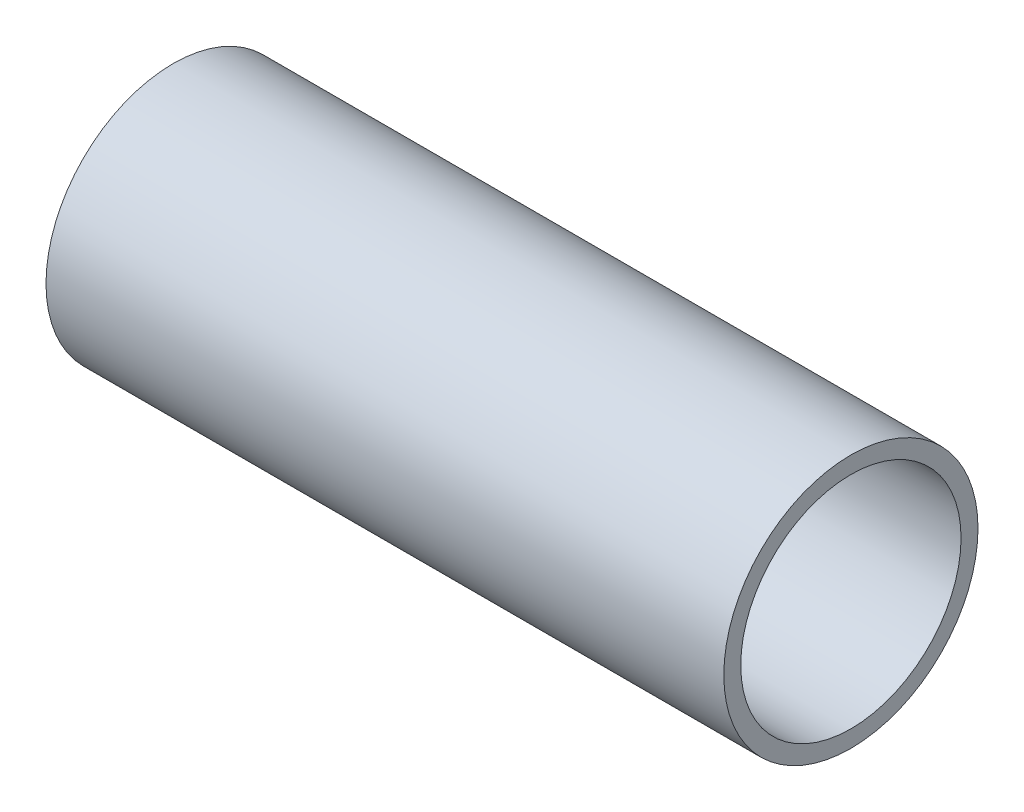
ISO-10303-21;
HEADER;
FILE_DESCRIPTION(('STEP AP214'),'2;1');
FILE_NAME('part.step','',(''),(''),'','','');
FILE_SCHEMA(('AUTOMOTIVE_DESIGN { 1 0 10303 214 1 1 1 1 }'));
ENDSEC;
DATA;
#1=APPLICATION_CONTEXT('core data for automotive mechanical design processes');
#2=APPLICATION_PROTOCOL_DEFINITION('international standard','automotive_design',2000,#1);
#3=PRODUCT_CONTEXT('',#1,'mechanical');
#4=PRODUCT('Part','Part','',(#3));
#5=PRODUCT_RELATED_PRODUCT_CATEGORY('part','',(#4));
#6=PRODUCT_DEFINITION_FORMATION('','',#4);
#7=PRODUCT_DEFINITION_CONTEXT('part definition',#1,'design');
#8=PRODUCT_DEFINITION('design','',#6,#7);
#9=PRODUCT_DEFINITION_SHAPE('','',#8);
#10=(LENGTH_UNIT() NAMED_UNIT(*) SI_UNIT(.MILLI.,.METRE.));
#11=(NAMED_UNIT(*) PLANE_ANGLE_UNIT() SI_UNIT($,.RADIAN.));
#12=(NAMED_UNIT(*) SI_UNIT($,.STERADIAN.) SOLID_ANGLE_UNIT());
#13=UNCERTAINTY_MEASURE_WITH_UNIT(LENGTH_MEASURE(1.E-05),#10,'distance_accuracy_value','');
#14=(GEOMETRIC_REPRESENTATION_CONTEXT(3) GLOBAL_UNCERTAINTY_ASSIGNED_CONTEXT((#13)) GLOBAL_UNIT_ASSIGNED_CONTEXT((#10,
#11,#12)) REPRESENTATION_CONTEXT('',''));
#15=CARTESIAN_POINT('',(0.,0.,0.));
#16=DIRECTION('',(0.,0.,1.));
#17=DIRECTION('',(1.,0.,0.));
#18=AXIS2_PLACEMENT_3D('',#15,#16,#17);
#19=CARTESIAN_POINT('',(120.,0.,0.));
#20=DIRECTION('',(1.,0.,0.));
#21=DIRECTION('',(0.,0.,-1.));
#22=AXIS2_PLACEMENT_3D('',#19,#20,#21);
#23=PLANE('',#22);
#24=CARTESIAN_POINT('',(120.,0.,0.));
#25=DIRECTION('',(1.,0.,0.));
#26=DIRECTION('',(0.,0.,-1.));
#27=AXIS2_PLACEMENT_3D('',#24,#25,#26);
#28=CIRCLE('',#27,22.5);
#29=CARTESIAN_POINT('',(120.,0.,-22.5));
#30=VERTEX_POINT('',#29);
#31=EDGE_CURVE('E10',#30,#30,#28,.T.);
#32=ORIENTED_EDGE('',*,*,#31,.T.);
#33=EDGE_LOOP('',(#32));
#34=FACE_BOUND('',#33,.T.);
#35=CARTESIAN_POINT('',(120.,0.,0.));
#36=DIRECTION('',(1.,0.,0.));
#37=DIRECTION('',(0.,0.,-1.));
#38=AXIS2_PLACEMENT_3D('',#35,#36,#37);
#39=CIRCLE('',#38,19.5);
#40=CARTESIAN_POINT('',(120.,0.,-19.5));
#41=VERTEX_POINT('',#40);
#42=EDGE_CURVE('E44',#41,#41,#39,.T.);
#43=ORIENTED_EDGE('',*,*,#42,.F.);
#44=EDGE_LOOP('',(#43));
#45=FACE_BOUND('',#44,.T.);
#46=ADVANCED_FACE('F33',(#34,#45),#23,.T.);
#47=CARTESIAN_POINT('',(0.,0.,0.));
#48=DIRECTION('',(1.,0.,0.));
#49=DIRECTION('',(0.,0.,-1.));
#50=AXIS2_PLACEMENT_3D('',#47,#48,#49);
#51=PLANE('',#50);
#52=CARTESIAN_POINT('',(0.,0.,0.));
#53=DIRECTION('',(1.,0.,0.));
#54=DIRECTION('',(0.,0.,-1.));
#55=AXIS2_PLACEMENT_3D('',#52,#53,#54);
#56=CIRCLE('',#55,22.5);
#57=CARTESIAN_POINT('',(0.,0.,-22.5));
#58=VERTEX_POINT('',#57);
#59=EDGE_CURVE('E37',#58,#58,#56,.T.);
#60=ORIENTED_EDGE('',*,*,#59,.F.);
#61=EDGE_LOOP('',(#60));
#62=FACE_BOUND('',#61,.T.);
#63=CARTESIAN_POINT('',(0.,0.,0.));
#64=DIRECTION('',(1.,0.,0.));
#65=DIRECTION('',(0.,0.,-1.));
#66=AXIS2_PLACEMENT_3D('',#63,#64,#65);
#67=CIRCLE('',#66,19.5);
#68=CARTESIAN_POINT('',(0.,0.,-19.5));
#69=VERTEX_POINT('',#68);
#70=EDGE_CURVE('E46',#69,#69,#67,.T.);
#71=ORIENTED_EDGE('',*,*,#70,.T.);
#72=EDGE_LOOP('',(#71));
#73=FACE_BOUND('',#72,.T.);
#74=ADVANCED_FACE('F56',(#62,#73),#51,.F.);
#75=CARTESIAN_POINT('',(120.,0.,0.));
#76=DIRECTION('',(-1.,0.,0.));
#77=DIRECTION('',(0.,0.,1.));
#78=AXIS2_PLACEMENT_3D('',#75,#76,#77);
#79=CYLINDRICAL_SURFACE('',#78,22.5);
#80=ORIENTED_EDGE('',*,*,#31,.F.);
#81=EDGE_LOOP('',(#80));
#82=FACE_BOUND('',#81,.T.);
#83=ORIENTED_EDGE('',*,*,#59,.T.);
#84=EDGE_LOOP('',(#83));
#85=FACE_BOUND('',#84,.T.);
#86=ADVANCED_FACE('F35',(#82,#85),#79,.T.);
#87=CARTESIAN_POINT('',(120.,0.,0.));
#88=DIRECTION('',(-1.,0.,0.));
#89=DIRECTION('',(0.,0.,1.));
#90=AXIS2_PLACEMENT_3D('',#87,#88,#89);
#91=CYLINDRICAL_SURFACE('',#90,19.5);
#92=ORIENTED_EDGE('',*,*,#42,.T.);
#93=EDGE_LOOP('',(#92));
#94=FACE_BOUND('',#93,.T.);
#95=ORIENTED_EDGE('',*,*,#70,.F.);
#96=EDGE_LOOP('',(#95));
#97=FACE_BOUND('',#96,.T.);
#98=ADVANCED_FACE('F52',(#94,#97),#91,.F.);
#99=CLOSED_SHELL('',(#46,#74,#86,#98));
#100=MANIFOLD_SOLID_BREP('B2',#99);
#101=ADVANCED_BREP_SHAPE_REPRESENTATION('',(#18,#100),#14);
#102=SHAPE_DEFINITION_REPRESENTATION(#9,#101);
ENDSEC;
END-ISO-10303-21;
